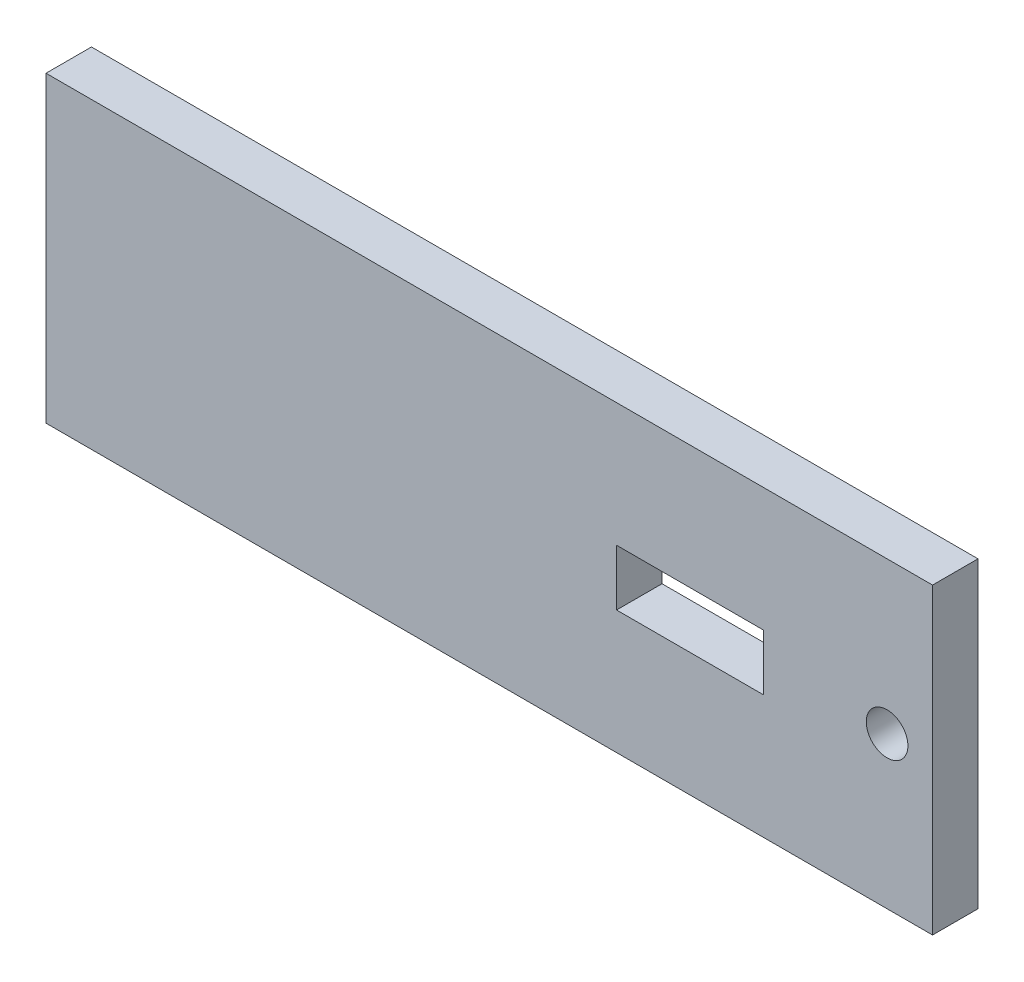
ISO-10303-21;
HEADER;
FILE_DESCRIPTION(('STEP AP214'),'2;1');
FILE_NAME('part.step','',(''),(''),'','','');
FILE_SCHEMA(('AUTOMOTIVE_DESIGN { 1 0 10303 214 1 1 1 1 }'));
ENDSEC;
DATA;
#1=APPLICATION_CONTEXT('core data for automotive mechanical design processes');
#2=APPLICATION_PROTOCOL_DEFINITION('international standard','automotive_design',2000,#1);
#3=PRODUCT_CONTEXT('',#1,'mechanical');
#4=PRODUCT('Part','Part','',(#3));
#5=PRODUCT_RELATED_PRODUCT_CATEGORY('part','',(#4));
#6=PRODUCT_DEFINITION_FORMATION('','',#4);
#7=PRODUCT_DEFINITION_CONTEXT('part definition',#1,'design');
#8=PRODUCT_DEFINITION('design','',#6,#7);
#9=PRODUCT_DEFINITION_SHAPE('','',#8);
#10=(LENGTH_UNIT() NAMED_UNIT(*) SI_UNIT(.MILLI.,.METRE.));
#11=(NAMED_UNIT(*) PLANE_ANGLE_UNIT() SI_UNIT($,.RADIAN.));
#12=(NAMED_UNIT(*) SI_UNIT($,.STERADIAN.) SOLID_ANGLE_UNIT());
#13=UNCERTAINTY_MEASURE_WITH_UNIT(LENGTH_MEASURE(1.E-05),#10,'distance_accuracy_value','');
#14=(GEOMETRIC_REPRESENTATION_CONTEXT(3) GLOBAL_UNCERTAINTY_ASSIGNED_CONTEXT((#13)) GLOBAL_UNIT_ASSIGNED_CONTEXT((#10,
#11,#12)) REPRESENTATION_CONTEXT('',''));
#15=CARTESIAN_POINT('',(0.,0.,0.));
#16=DIRECTION('',(0.,0.,1.));
#17=DIRECTION('',(1.,0.,0.));
#18=AXIS2_PLACEMENT_3D('',#15,#16,#17);
#19=CARTESIAN_POINT('',(0.,-10.,17.2));
#20=DIRECTION('',(0.,0.,-1.));
#21=DIRECTION('',(-1.,0.,0.));
#22=AXIS2_PLACEMENT_3D('',#19,#20,#21);
#23=PLANE('',#22);
#24=DIRECTION('',(0.,1.,0.));
#25=VECTOR('',#24,1.);
#26=CARTESIAN_POINT('',(-53.2563185301842,-10.,17.2));
#27=LINE('',#26,#25);
#28=CARTESIAN_POINT('',(-53.2563185301842,-10.,17.2));
#29=VERTEX_POINT('',#28);
#30=CARTESIAN_POINT('',(-53.2563185301842,10.,17.2));
#31=VERTEX_POINT('',#30);
#32=EDGE_CURVE('E12',#29,#31,#27,.T.);
#33=ORIENTED_EDGE('',*,*,#32,.T.);
#34=DIRECTION('',(-1.,0.,0.));
#35=VECTOR('',#34,1.);
#36=CARTESIAN_POINT('',(0.,10.,17.2));
#37=LINE('',#36,#35);
#38=CARTESIAN_POINT('',(5.24368146981578,10.,17.2));
#39=VERTEX_POINT('',#38);
#40=EDGE_CURVE('E193',#39,#31,#37,.T.);
#41=ORIENTED_EDGE('',*,*,#40,.F.);
#42=DIRECTION('',(0.,-1.,0.));
#43=VECTOR('',#42,1.);
#44=CARTESIAN_POINT('',(5.24368146981578,10.,17.2));
#45=LINE('',#44,#43);
#46=CARTESIAN_POINT('',(5.24368146981578,-10.,17.2));
#47=VERTEX_POINT('',#46);
#48=EDGE_CURVE('E184',#39,#47,#45,.T.);
#49=ORIENTED_EDGE('',*,*,#48,.T.);
#50=DIRECTION('',(-1.,0.,0.));
#51=VECTOR('',#50,1.);
#52=CARTESIAN_POINT('',(0.,-10.,17.2));
#53=LINE('',#52,#51);
#54=EDGE_CURVE('E200',#47,#29,#53,.T.);
#55=ORIENTED_EDGE('',*,*,#54,.T.);
#56=EDGE_LOOP('',(#33,#41,#49,#55));
#57=FACE_BOUND('',#56,.T.);
#58=DIRECTION('',(0.,1.,0.));
#59=VECTOR('',#58,1.);
#60=CARTESIAN_POINT('',(-15.6063185301842,-1.85,17.2));
#61=LINE('',#60,#59);
#62=CARTESIAN_POINT('',(-15.6063185301842,-1.85,17.2));
#63=VERTEX_POINT('',#62);
#64=CARTESIAN_POINT('',(-15.6063185301842,1.85,17.2));
#65=VERTEX_POINT('',#64);
#66=EDGE_CURVE('E169',#63,#65,#61,.T.);
#67=ORIENTED_EDGE('',*,*,#66,.F.);
#68=DIRECTION('',(-1.,0.,0.));
#69=VECTOR('',#68,1.);
#70=CARTESIAN_POINT('',(0.,-1.85,17.2));
#71=LINE('',#70,#69);
#72=CARTESIAN_POINT('',(-5.90631853018422,-1.85,17.2));
#73=VERTEX_POINT('',#72);
#74=EDGE_CURVE('E164',#73,#63,#71,.T.);
#75=ORIENTED_EDGE('',*,*,#74,.F.);
#76=DIRECTION('',(0.,1.,0.));
#77=VECTOR('',#76,1.);
#78=CARTESIAN_POINT('',(-5.90631853018422,-1.85,17.2));
#79=LINE('',#78,#77);
#80=CARTESIAN_POINT('',(-5.90631853018422,1.85,17.2));
#81=VERTEX_POINT('',#80);
#82=EDGE_CURVE('E163',#73,#81,#79,.T.);
#83=ORIENTED_EDGE('',*,*,#82,.T.);
#84=DIRECTION('',(-1.,0.,0.));
#85=VECTOR('',#84,1.);
#86=CARTESIAN_POINT('',(0.,1.85,17.2));
#87=LINE('',#86,#85);
#88=EDGE_CURVE('E222',#81,#65,#87,.T.);
#89=ORIENTED_EDGE('',*,*,#88,.T.);
#90=EDGE_LOOP('',(#67,#75,#83,#89));
#91=FACE_BOUND('',#90,.T.);
#92=ADVANCED_FACE('F83',(#57,#91),#23,.T.);
#93=CARTESIAN_POINT('',(0.,-10.,20.2));
#94=DIRECTION('',(0.,0.,-1.));
#95=DIRECTION('',(-1.,0.,0.));
#96=AXIS2_PLACEMENT_3D('',#93,#94,#95);
#97=PLANE('',#96);
#98=CARTESIAN_POINT('',(2.24368146981578,0.,20.2));
#99=DIRECTION('',(0.,0.,1.));
#100=DIRECTION('',(1.,0.,0.));
#101=AXIS2_PLACEMENT_3D('',#98,#99,#100);
#102=CIRCLE('',#101,1.375);
#103=CARTESIAN_POINT('',(3.61868146981578,0.,20.2));
#104=VERTEX_POINT('',#103);
#105=EDGE_CURVE('E232',#104,#104,#102,.T.);
#106=ORIENTED_EDGE('',*,*,#105,.F.);
#107=EDGE_LOOP('',(#106));
#108=FACE_BOUND('',#107,.T.);
#109=DIRECTION('',(-1.,0.,0.));
#110=VECTOR('',#109,1.);
#111=CARTESIAN_POINT('',(0.,-10.,20.2));
#112=LINE('',#111,#110);
#113=CARTESIAN_POINT('',(5.24368146981578,-10.,20.2));
#114=VERTEX_POINT('',#113);
#115=CARTESIAN_POINT('',(-53.2563185301842,-10.,20.2));
#116=VERTEX_POINT('',#115);
#117=EDGE_CURVE('E198',#114,#116,#112,.T.);
#118=ORIENTED_EDGE('',*,*,#117,.F.);
#119=DIRECTION('',(0.,-1.,0.));
#120=VECTOR('',#119,1.);
#121=CARTESIAN_POINT('',(5.24368146981578,10.,20.2));
#122=LINE('',#121,#120);
#123=CARTESIAN_POINT('',(5.24368146981578,10.,20.2));
#124=VERTEX_POINT('',#123);
#125=EDGE_CURVE('E181',#124,#114,#122,.T.);
#126=ORIENTED_EDGE('',*,*,#125,.F.);
#127=DIRECTION('',(-1.,0.,0.));
#128=VECTOR('',#127,1.);
#129=CARTESIAN_POINT('',(0.,10.,20.2));
#130=LINE('',#129,#128);
#131=CARTESIAN_POINT('',(-53.2563185301842,10.,20.2));
#132=VERTEX_POINT('',#131);
#133=EDGE_CURVE('E190',#124,#132,#130,.T.);
#134=ORIENTED_EDGE('',*,*,#133,.T.);
#135=DIRECTION('',(0.,1.,0.));
#136=VECTOR('',#135,1.);
#137=CARTESIAN_POINT('',(-53.2563185301842,-10.,20.2));
#138=LINE('',#137,#136);
#139=EDGE_CURVE('E87',#116,#132,#138,.T.);
#140=ORIENTED_EDGE('',*,*,#139,.F.);
#141=EDGE_LOOP('',(#118,#126,#134,#140));
#142=FACE_BOUND('',#141,.T.);
#143=DIRECTION('',(-1.,0.,0.));
#144=VECTOR('',#143,1.);
#145=CARTESIAN_POINT('',(0.,-1.85,20.2));
#146=LINE('',#145,#144);
#147=CARTESIAN_POINT('',(-5.90631853018422,-1.85,20.2));
#148=VERTEX_POINT('',#147);
#149=CARTESIAN_POINT('',(-15.6063185301842,-1.85,20.2));
#150=VERTEX_POINT('',#149);
#151=EDGE_CURVE('E146',#148,#150,#146,.T.);
#152=ORIENTED_EDGE('',*,*,#151,.T.);
#153=DIRECTION('',(0.,1.,0.));
#154=VECTOR('',#153,1.);
#155=CARTESIAN_POINT('',(-15.6063185301842,-1.85,20.2));
#156=LINE('',#155,#154);
#157=CARTESIAN_POINT('',(-15.6063185301842,1.85,20.2));
#158=VERTEX_POINT('',#157);
#159=EDGE_CURVE('E178',#150,#158,#156,.T.);
#160=ORIENTED_EDGE('',*,*,#159,.T.);
#161=DIRECTION('',(-1.,0.,0.));
#162=VECTOR('',#161,1.);
#163=CARTESIAN_POINT('',(0.,1.85,20.2));
#164=LINE('',#163,#162);
#165=CARTESIAN_POINT('',(-5.90631853018422,1.85,20.2));
#166=VERTEX_POINT('',#165);
#167=EDGE_CURVE('E167',#166,#158,#164,.T.);
#168=ORIENTED_EDGE('',*,*,#167,.F.);
#169=DIRECTION('',(0.,1.,0.));
#170=VECTOR('',#169,1.);
#171=CARTESIAN_POINT('',(-5.90631853018422,-1.85,20.2));
#172=LINE('',#171,#170);
#173=EDGE_CURVE('E160',#148,#166,#172,.T.);
#174=ORIENTED_EDGE('',*,*,#173,.F.);
#175=EDGE_LOOP('',(#152,#160,#168,#174));
#176=FACE_BOUND('',#175,.T.);
#177=ADVANCED_FACE('F166',(#108,#142,#176),#97,.F.);
#178=CARTESIAN_POINT('',(-53.2563185301842,-10.,0.));
#179=DIRECTION('',(1.,0.,0.));
#180=DIRECTION('',(0.,0.,-1.));
#181=AXIS2_PLACEMENT_3D('',#178,#179,#180);
#182=PLANE('',#181);
#183=ORIENTED_EDGE('',*,*,#139,.T.);
#184=DIRECTION('',(0.,0.,-1.));
#185=VECTOR('',#184,1.);
#186=CARTESIAN_POINT('',(-53.2563185301842,10.,0.));
#187=LINE('',#186,#185);
#188=EDGE_CURVE('E187',#132,#31,#187,.T.);
#189=ORIENTED_EDGE('',*,*,#188,.T.);
#190=ORIENTED_EDGE('',*,*,#32,.F.);
#191=DIRECTION('',(0.,0.,-1.));
#192=VECTOR('',#191,1.);
#193=CARTESIAN_POINT('',(-53.2563185301842,-10.,0.));
#194=LINE('',#193,#192);
#195=EDGE_CURVE('E196',#116,#29,#194,.T.);
#196=ORIENTED_EDGE('',*,*,#195,.F.);
#197=EDGE_LOOP('',(#183,#189,#190,#196));
#198=FACE_BOUND('',#197,.T.);
#199=ADVANCED_FACE('F85',(#198),#182,.F.);
#200=CARTESIAN_POINT('',(0.,-10.,0.));
#201=DIRECTION('',(0.,1.,0.));
#202=DIRECTION('',(0.,0.,1.));
#203=AXIS2_PLACEMENT_3D('',#200,#201,#202);
#204=PLANE('',#203);
#205=ORIENTED_EDGE('',*,*,#195,.T.);
#206=ORIENTED_EDGE('',*,*,#54,.F.);
#207=DIRECTION('',(0.,0.,-1.));
#208=VECTOR('',#207,1.);
#209=CARTESIAN_POINT('',(5.24368146981578,-10.,20.2));
#210=LINE('',#209,#208);
#211=EDGE_CURVE('E174',#114,#47,#210,.T.);
#212=ORIENTED_EDGE('',*,*,#211,.F.);
#213=ORIENTED_EDGE('',*,*,#117,.T.);
#214=EDGE_LOOP('',(#205,#206,#212,#213));
#215=FACE_BOUND('',#214,.T.);
#216=ADVANCED_FACE('F253',(#215),#204,.F.);
#217=CARTESIAN_POINT('',(0.,10.,0.));
#218=DIRECTION('',(0.,1.,0.));
#219=DIRECTION('',(0.,0.,1.));
#220=AXIS2_PLACEMENT_3D('',#217,#218,#219);
#221=PLANE('',#220);
#222=ORIENTED_EDGE('',*,*,#188,.F.);
#223=ORIENTED_EDGE('',*,*,#133,.F.);
#224=DIRECTION('',(0.,0.,-1.));
#225=VECTOR('',#224,1.);
#226=CARTESIAN_POINT('',(5.24368146981578,10.,20.2));
#227=LINE('',#226,#225);
#228=EDGE_CURVE('E177',#124,#39,#227,.T.);
#229=ORIENTED_EDGE('',*,*,#228,.T.);
#230=ORIENTED_EDGE('',*,*,#40,.T.);
#231=EDGE_LOOP('',(#222,#223,#229,#230));
#232=FACE_BOUND('',#231,.T.);
#233=ADVANCED_FACE('F210',(#232),#221,.T.);
#234=CARTESIAN_POINT('',(5.24368146981578,10.,20.2));
#235=DIRECTION('',(-1.,0.,0.));
#236=DIRECTION('',(0.,0.,1.));
#237=AXIS2_PLACEMENT_3D('',#234,#235,#236);
#238=PLANE('',#237);
#239=ORIENTED_EDGE('',*,*,#125,.T.);
#240=ORIENTED_EDGE('',*,*,#211,.T.);
#241=ORIENTED_EDGE('',*,*,#48,.F.);
#242=ORIENTED_EDGE('',*,*,#228,.F.);
#243=EDGE_LOOP('',(#239,#240,#241,#242));
#244=FACE_BOUND('',#243,.T.);
#245=ADVANCED_FACE('F216',(#244),#238,.F.);
#246=CARTESIAN_POINT('',(-15.6063185301842,-1.85,0.));
#247=DIRECTION('',(1.,0.,0.));
#248=DIRECTION('',(0.,0.,-1.));
#249=AXIS2_PLACEMENT_3D('',#246,#247,#248);
#250=PLANE('',#249);
#251=DIRECTION('',(0.,0.,-1.));
#252=VECTOR('',#251,1.);
#253=CARTESIAN_POINT('',(-15.6063185301842,1.85,0.));
#254=LINE('',#253,#252);
#255=EDGE_CURVE('E98',#158,#65,#254,.T.);
#256=ORIENTED_EDGE('',*,*,#255,.F.);
#257=ORIENTED_EDGE('',*,*,#159,.F.);
#258=DIRECTION('',(0.,0.,-1.));
#259=VECTOR('',#258,1.);
#260=CARTESIAN_POINT('',(-15.6063185301842,-1.85,0.));
#261=LINE('',#260,#259);
#262=EDGE_CURVE('E152',#150,#63,#261,.T.);
#263=ORIENTED_EDGE('',*,*,#262,.T.);
#264=ORIENTED_EDGE('',*,*,#66,.T.);
#265=EDGE_LOOP('',(#256,#257,#263,#264));
#266=FACE_BOUND('',#265,.T.);
#267=ADVANCED_FACE('F262',(#266),#250,.T.);
#268=CARTESIAN_POINT('',(-5.90631853018422,-1.85,0.));
#269=DIRECTION('',(1.,0.,0.));
#270=DIRECTION('',(0.,0.,-1.));
#271=AXIS2_PLACEMENT_3D('',#268,#269,#270);
#272=PLANE('',#271);
#273=DIRECTION('',(0.,0.,-1.));
#274=VECTOR('',#273,1.);
#275=CARTESIAN_POINT('',(-5.90631853018422,1.85,0.));
#276=LINE('',#275,#274);
#277=EDGE_CURVE('E103',#166,#81,#276,.T.);
#278=ORIENTED_EDGE('',*,*,#277,.T.);
#279=ORIENTED_EDGE('',*,*,#82,.F.);
#280=DIRECTION('',(0.,0.,-1.));
#281=VECTOR('',#280,1.);
#282=CARTESIAN_POINT('',(-5.90631853018422,-1.85,0.));
#283=LINE('',#282,#281);
#284=EDGE_CURVE('E150',#148,#73,#283,.T.);
#285=ORIENTED_EDGE('',*,*,#284,.F.);
#286=ORIENTED_EDGE('',*,*,#173,.T.);
#287=EDGE_LOOP('',(#278,#279,#285,#286));
#288=FACE_BOUND('',#287,.T.);
#289=ADVANCED_FACE('F159',(#288),#272,.F.);
#290=CARTESIAN_POINT('',(0.,-1.85,0.));
#291=DIRECTION('',(0.,1.,0.));
#292=DIRECTION('',(0.,0.,1.));
#293=AXIS2_PLACEMENT_3D('',#290,#291,#292);
#294=PLANE('',#293);
#295=ORIENTED_EDGE('',*,*,#151,.F.);
#296=ORIENTED_EDGE('',*,*,#284,.T.);
#297=ORIENTED_EDGE('',*,*,#74,.T.);
#298=ORIENTED_EDGE('',*,*,#262,.F.);
#299=EDGE_LOOP('',(#295,#296,#297,#298));
#300=FACE_BOUND('',#299,.T.);
#301=ADVANCED_FACE('F148',(#300),#294,.T.);
#302=CARTESIAN_POINT('',(0.,1.85,0.));
#303=DIRECTION('',(0.,1.,0.));
#304=DIRECTION('',(0.,0.,1.));
#305=AXIS2_PLACEMENT_3D('',#302,#303,#304);
#306=PLANE('',#305);
#307=ORIENTED_EDGE('',*,*,#167,.T.);
#308=ORIENTED_EDGE('',*,*,#255,.T.);
#309=ORIENTED_EDGE('',*,*,#88,.F.);
#310=ORIENTED_EDGE('',*,*,#277,.F.);
#311=EDGE_LOOP('',(#307,#308,#309,#310));
#312=FACE_BOUND('',#311,.T.);
#313=ADVANCED_FACE('F243',(#312),#306,.F.);
#314=CARTESIAN_POINT('',(2.24368146981578,0.,18.2));
#315=DIRECTION('',(0.,0.,1.));
#316=DIRECTION('',(1.,0.,0.));
#317=AXIS2_PLACEMENT_3D('',#314,#315,#316);
#318=CYLINDRICAL_SURFACE('',#317,1.375);
#319=CARTESIAN_POINT('',(2.24368146981578,0.,18.2));
#320=DIRECTION('',(0.,0.,1.));
#321=DIRECTION('',(1.,0.,0.));
#322=AXIS2_PLACEMENT_3D('',#319,#320,#321);
#323=CIRCLE('',#322,1.375);
#324=CARTESIAN_POINT('',(3.61868146981578,0.,18.2));
#325=VERTEX_POINT('',#324);
#326=EDGE_CURVE('E229',#325,#325,#323,.T.);
#327=ORIENTED_EDGE('',*,*,#326,.F.);
#328=EDGE_LOOP('',(#327));
#329=FACE_BOUND('',#328,.T.);
#330=ORIENTED_EDGE('',*,*,#105,.T.);
#331=EDGE_LOOP('',(#330));
#332=FACE_BOUND('',#331,.T.);
#333=ADVANCED_FACE('F240',(#329,#332),#318,.F.);
#334=CARTESIAN_POINT('',(2.24368146981578,0.,18.2));
#335=DIRECTION('',(0.,0.,1.));
#336=DIRECTION('',(1.,0.,0.));
#337=AXIS2_PLACEMENT_3D('',#334,#335,#336);
#338=PLANE('',#337);
#339=ORIENTED_EDGE('',*,*,#326,.T.);
#340=EDGE_LOOP('',(#339));
#341=FACE_BOUND('',#340,.T.);
#342=ADVANCED_FACE('F238',(#341),#338,.T.);
#343=CLOSED_SHELL('',(#92,#177,#199,#216,#233,#245,#267,#289,#301,#313,#333,#342));
#344=MANIFOLD_SOLID_BREP('B2',#343);
#345=ADVANCED_BREP_SHAPE_REPRESENTATION('',(#18,#344),#14);
#346=SHAPE_DEFINITION_REPRESENTATION(#9,#345);
ENDSEC;
END-ISO-10303-21;
